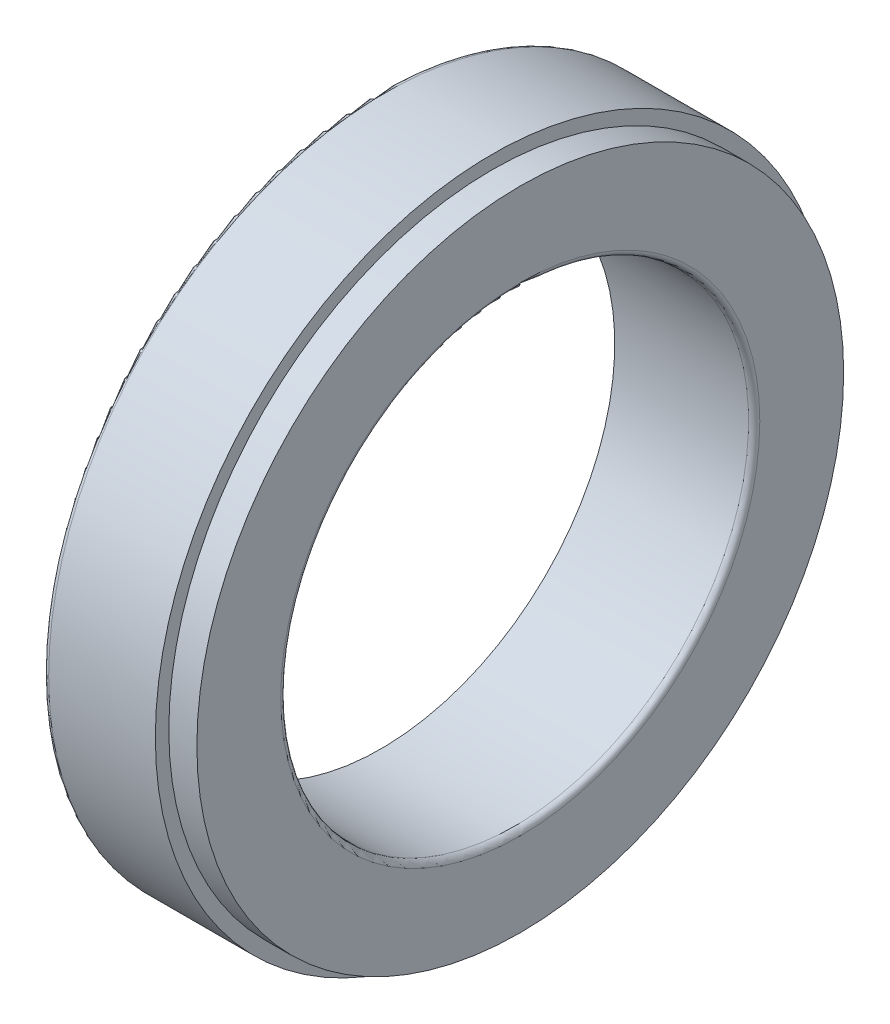
ISO-10303-21;
HEADER;
FILE_DESCRIPTION(('STEP AP214'),'2;1');
FILE_NAME('part.step','',(''),(''),'','','');
FILE_SCHEMA(('AUTOMOTIVE_DESIGN { 1 0 10303 214 1 1 1 1 }'));
ENDSEC;
DATA;
#1=APPLICATION_CONTEXT('core data for automotive mechanical design processes');
#2=APPLICATION_PROTOCOL_DEFINITION('international standard','automotive_design',2000,#1);
#3=PRODUCT_CONTEXT('',#1,'mechanical');
#4=PRODUCT('Part','Part','',(#3));
#5=PRODUCT_RELATED_PRODUCT_CATEGORY('part','',(#4));
#6=PRODUCT_DEFINITION_FORMATION('','',#4);
#7=PRODUCT_DEFINITION_CONTEXT('part definition',#1,'design');
#8=PRODUCT_DEFINITION('design','',#6,#7);
#9=PRODUCT_DEFINITION_SHAPE('','',#8);
#10=(LENGTH_UNIT() NAMED_UNIT(*) SI_UNIT(.MILLI.,.METRE.));
#11=(NAMED_UNIT(*) PLANE_ANGLE_UNIT() SI_UNIT($,.RADIAN.));
#12=(NAMED_UNIT(*) SI_UNIT($,.STERADIAN.) SOLID_ANGLE_UNIT());
#13=UNCERTAINTY_MEASURE_WITH_UNIT(LENGTH_MEASURE(1.E-05),#10,'distance_accuracy_value','');
#14=(GEOMETRIC_REPRESENTATION_CONTEXT(3) GLOBAL_UNCERTAINTY_ASSIGNED_CONTEXT((#13)) GLOBAL_UNIT_ASSIGNED_CONTEXT((#10,
#11,#12)) REPRESENTATION_CONTEXT('',''));
#15=CARTESIAN_POINT('',(0.,0.,0.));
#16=DIRECTION('',(0.,0.,1.));
#17=DIRECTION('',(1.,0.,0.));
#18=AXIS2_PLACEMENT_3D('',#15,#16,#17);
#19=CARTESIAN_POINT('',(-1000.,0.,0.));
#20=DIRECTION('',(-1.,0.,0.));
#21=DIRECTION('',(0.,0.,1.));
#22=AXIS2_PLACEMENT_3D('',#19,#20,#21);
#23=CYLINDRICAL_SURFACE('',#22,31.374);
#24=CARTESIAN_POINT('',(0.099999999999989,0.,0.));
#25=DIRECTION('',(-1.,0.,0.));
#26=DIRECTION('',(0.,0.,1.));
#27=AXIS2_PLACEMENT_3D('',#24,#25,#26);
#28=CIRCLE('',#27,31.374);
#29=CARTESIAN_POINT('',(0.099999999999989,0.,31.374));
#30=VERTEX_POINT('',#29);
#31=EDGE_CURVE('E10',#30,#30,#28,.T.);
#32=ORIENTED_EDGE('',*,*,#31,.F.);
#33=EDGE_LOOP('',(#32));
#34=FACE_BOUND('',#33,.T.);
#35=CARTESIAN_POINT('',(0.,0.,0.));
#36=DIRECTION('',(-1.,0.,0.));
#37=DIRECTION('',(0.,0.,1.));
#38=AXIS2_PLACEMENT_3D('',#35,#36,#37);
#39=CIRCLE('',#38,31.374);
#40=CARTESIAN_POINT('',(0.,0.,31.374));
#41=VERTEX_POINT('',#40);
#42=EDGE_CURVE('E66',#41,#41,#39,.T.);
#43=ORIENTED_EDGE('',*,*,#42,.T.);
#44=EDGE_LOOP('',(#43));
#45=FACE_BOUND('',#44,.T.);
#46=ADVANCED_FACE('F32',(#34,#45),#23,.F.);
#47=CARTESIAN_POINT('',(0.100000000000003,31.374,0.));
#48=DIRECTION('',(1.,0.,0.));
#49=DIRECTION('',(0.,0.,-1.));
#50=AXIS2_PLACEMENT_3D('',#47,#48,#49);
#51=PLANE('',#50);
#52=CARTESIAN_POINT('',(0.099999999999989,0.,0.));
#53=DIRECTION('',(-1.,0.,0.));
#54=DIRECTION('',(0.,0.,1.));
#55=AXIS2_PLACEMENT_3D('',#52,#53,#54);
#56=CIRCLE('',#55,25.);
#57=CARTESIAN_POINT('',(0.099999999999989,0.,25.));
#58=VERTEX_POINT('',#57);
#59=EDGE_CURVE('E38',#58,#58,#56,.T.);
#60=ORIENTED_EDGE('',*,*,#59,.F.);
#61=EDGE_LOOP('',(#60));
#62=FACE_BOUND('',#61,.T.);
#63=ORIENTED_EDGE('',*,*,#31,.T.);
#64=EDGE_LOOP('',(#63));
#65=FACE_BOUND('',#64,.T.);
#66=ADVANCED_FACE('F115',(#62,#65),#51,.F.);
#67=CARTESIAN_POINT('',(-1000.,0.,0.));
#68=DIRECTION('',(-1.,0.,0.));
#69=DIRECTION('',(0.,0.,1.));
#70=AXIS2_PLACEMENT_3D('',#67,#68,#69);
#71=CYLINDRICAL_SURFACE('',#70,25.);
#72=CARTESIAN_POINT('',(14.4,0.,0.));
#73=DIRECTION('',(-1.,0.,0.));
#74=DIRECTION('',(0.,0.,1.));
#75=AXIS2_PLACEMENT_3D('',#72,#73,#74);
#76=CIRCLE('',#75,25.);
#77=CARTESIAN_POINT('',(14.4,0.,25.));
#78=VERTEX_POINT('',#77);
#79=EDGE_CURVE('E42',#78,#78,#76,.T.);
#80=ORIENTED_EDGE('',*,*,#79,.F.);
#81=EDGE_LOOP('',(#80));
#82=FACE_BOUND('',#81,.T.);
#83=ORIENTED_EDGE('',*,*,#59,.T.);
#84=EDGE_LOOP('',(#83));
#85=FACE_BOUND('',#84,.T.);
#86=ADVANCED_FACE('F110',(#82,#85),#71,.F.);
#87=CARTESIAN_POINT('',(14.4,0.,0.));
#88=DIRECTION('',(-1.,0.,0.));
#89=DIRECTION('',(0.,0.,1.));
#90=AXIS2_PLACEMENT_3D('',#87,#88,#89);
#91=TOROIDAL_SURFACE('',#90,25.6,0.6);
#92=CARTESIAN_POINT('',(14.9999999999999,0.,0.));
#93=DIRECTION('',(-1.,0.,0.));
#94=DIRECTION('',(0.,0.,1.));
#95=AXIS2_PLACEMENT_3D('',#92,#93,#94);
#96=CIRCLE('',#95,25.6);
#97=CARTESIAN_POINT('',(14.9999999999999,0.,25.6));
#98=VERTEX_POINT('',#97);
#99=EDGE_CURVE('E46',#98,#98,#96,.T.);
#100=ORIENTED_EDGE('',*,*,#99,.F.);
#101=EDGE_LOOP('',(#100));
#102=FACE_BOUND('',#101,.T.);
#103=ORIENTED_EDGE('',*,*,#79,.T.);
#104=EDGE_LOOP('',(#103));
#105=FACE_BOUND('',#104,.T.);
#106=ADVANCED_FACE('F104',(#102,#105),#91,.T.);
#107=CARTESIAN_POINT('',(15.,34.561,0.));
#108=DIRECTION('',(-1.,0.,0.));
#109=DIRECTION('',(0.,0.,1.));
#110=AXIS2_PLACEMENT_3D('',#107,#108,#109);
#111=PLANE('',#110);
#112=CARTESIAN_POINT('',(14.9999999999999,0.,0.));
#113=DIRECTION('',(-1.,0.,0.));
#114=DIRECTION('',(0.,0.,1.));
#115=AXIS2_PLACEMENT_3D('',#112,#113,#114);
#116=CIRCLE('',#115,34.561);
#117=CARTESIAN_POINT('',(14.9999999999999,0.,34.561));
#118=VERTEX_POINT('',#117);
#119=EDGE_CURVE('E51',#118,#118,#116,.T.);
#120=ORIENTED_EDGE('',*,*,#119,.F.);
#121=EDGE_LOOP('',(#120));
#122=FACE_BOUND('',#121,.T.);
#123=ORIENTED_EDGE('',*,*,#99,.T.);
#124=EDGE_LOOP('',(#123));
#125=FACE_BOUND('',#124,.T.);
#126=ADVANCED_FACE('F98',(#122,#125),#111,.F.);
#127=CARTESIAN_POINT('',(-1000.,0.,0.));
#128=DIRECTION('',(-1.,0.,0.));
#129=DIRECTION('',(0.,0.,1.));
#130=AXIS2_PLACEMENT_3D('',#127,#128,#129);
#131=CYLINDRICAL_SURFACE('',#130,34.561);
#132=CARTESIAN_POINT('',(12.,0.,0.));
#133=DIRECTION('',(-1.,0.,0.));
#134=DIRECTION('',(0.,0.,1.));
#135=AXIS2_PLACEMENT_3D('',#132,#133,#134);
#136=CIRCLE('',#135,34.561);
#137=CARTESIAN_POINT('',(12.,0.,34.561));
#138=VERTEX_POINT('',#137);
#139=EDGE_CURVE('E54',#138,#138,#136,.T.);
#140=ORIENTED_EDGE('',*,*,#139,.F.);
#141=EDGE_LOOP('',(#140));
#142=FACE_BOUND('',#141,.T.);
#143=ORIENTED_EDGE('',*,*,#119,.T.);
#144=EDGE_LOOP('',(#143));
#145=FACE_BOUND('',#144,.T.);
#146=ADVANCED_FACE('F92',(#142,#145),#131,.T.);
#147=CARTESIAN_POINT('',(12.,36.,0.));
#148=DIRECTION('',(-1.,0.,0.));
#149=DIRECTION('',(0.,0.,1.));
#150=AXIS2_PLACEMENT_3D('',#147,#148,#149);
#151=PLANE('',#150);
#152=CARTESIAN_POINT('',(12.,0.,0.));
#153=DIRECTION('',(-1.,0.,0.));
#154=DIRECTION('',(0.,0.,1.));
#155=AXIS2_PLACEMENT_3D('',#152,#153,#154);
#156=CIRCLE('',#155,36.);
#157=CARTESIAN_POINT('',(12.,0.,36.));
#158=VERTEX_POINT('',#157);
#159=EDGE_CURVE('E57',#158,#158,#156,.T.);
#160=ORIENTED_EDGE('',*,*,#159,.F.);
#161=EDGE_LOOP('',(#160));
#162=FACE_BOUND('',#161,.T.);
#163=ORIENTED_EDGE('',*,*,#139,.T.);
#164=EDGE_LOOP('',(#163));
#165=FACE_BOUND('',#164,.T.);
#166=ADVANCED_FACE('F86',(#162,#165),#151,.F.);
#167=CARTESIAN_POINT('',(-1000.,0.,0.));
#168=DIRECTION('',(-1.,0.,0.));
#169=DIRECTION('',(0.,0.,1.));
#170=AXIS2_PLACEMENT_3D('',#167,#168,#169);
#171=CYLINDRICAL_SURFACE('',#170,36.);
#172=CARTESIAN_POINT('',(0.599999999999934,0.,0.));
#173=DIRECTION('',(-1.,0.,0.));
#174=DIRECTION('',(0.,0.,1.));
#175=AXIS2_PLACEMENT_3D('',#172,#173,#174);
#176=CIRCLE('',#175,36.);
#177=CARTESIAN_POINT('',(0.599999999999934,0.,36.));
#178=VERTEX_POINT('',#177);
#179=EDGE_CURVE('E60',#178,#178,#176,.T.);
#180=ORIENTED_EDGE('',*,*,#179,.F.);
#181=EDGE_LOOP('',(#180));
#182=FACE_BOUND('',#181,.T.);
#183=ORIENTED_EDGE('',*,*,#159,.T.);
#184=EDGE_LOOP('',(#183));
#185=FACE_BOUND('',#184,.T.);
#186=ADVANCED_FACE('F80',(#182,#185),#171,.T.);
#187=CARTESIAN_POINT('',(0.6,0.,0.));
#188=DIRECTION('',(-1.,0.,0.));
#189=DIRECTION('',(0.,0.,1.));
#190=AXIS2_PLACEMENT_3D('',#187,#188,#189);
#191=TOROIDAL_SURFACE('',#190,35.4,0.599999999999998);
#192=CARTESIAN_POINT('',(0.,0.,0.));
#193=DIRECTION('',(-1.,0.,0.));
#194=DIRECTION('',(0.,0.,1.));
#195=AXIS2_PLACEMENT_3D('',#192,#193,#194);
#196=CIRCLE('',#195,35.4);
#197=CARTESIAN_POINT('',(0.,0.,35.4));
#198=VERTEX_POINT('',#197);
#199=EDGE_CURVE('E63',#198,#198,#196,.T.);
#200=ORIENTED_EDGE('',*,*,#199,.F.);
#201=EDGE_LOOP('',(#200));
#202=FACE_BOUND('',#201,.T.);
#203=ORIENTED_EDGE('',*,*,#179,.T.);
#204=EDGE_LOOP('',(#203));
#205=FACE_BOUND('',#204,.T.);
#206=ADVANCED_FACE('F74',(#202,#205),#191,.T.);
#207=CARTESIAN_POINT('',(0.,35.4,0.));
#208=DIRECTION('',(1.,0.,0.));
#209=DIRECTION('',(0.,0.,-1.));
#210=AXIS2_PLACEMENT_3D('',#207,#208,#209);
#211=PLANE('',#210);
#212=ORIENTED_EDGE('',*,*,#42,.F.);
#213=EDGE_LOOP('',(#212));
#214=FACE_BOUND('',#213,.T.);
#215=ORIENTED_EDGE('',*,*,#199,.T.);
#216=EDGE_LOOP('',(#215));
#217=FACE_BOUND('',#216,.T.);
#218=ADVANCED_FACE('F71',(#214,#217),#211,.F.);
#219=CLOSED_SHELL('',(#46,#66,#86,#106,#126,#146,#166,#186,#206,#218));
#220=MANIFOLD_SOLID_BREP('B2',#219);
#221=ADVANCED_BREP_SHAPE_REPRESENTATION('',(#18,#220),#14);
#222=SHAPE_DEFINITION_REPRESENTATION(#9,#221);
ENDSEC;
END-ISO-10303-21;
